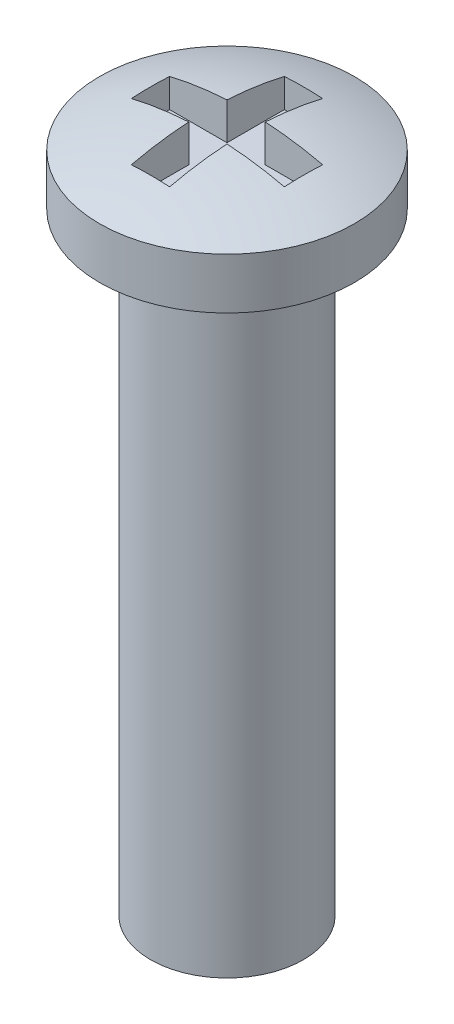
ISO-10303-21;
HEADER;
FILE_DESCRIPTION(('STEP AP214'),'2;1');
FILE_NAME('part.step','',(''),(''),'','','');
FILE_SCHEMA(('AUTOMOTIVE_DESIGN { 1 0 10303 214 1 1 1 1 }'));
ENDSEC;
DATA;
#1=APPLICATION_CONTEXT('core data for automotive mechanical design processes');
#2=APPLICATION_PROTOCOL_DEFINITION('international standard','automotive_design',2000,#1);
#3=PRODUCT_CONTEXT('',#1,'mechanical');
#4=PRODUCT('Part','Part','',(#3));
#5=PRODUCT_RELATED_PRODUCT_CATEGORY('part','',(#4));
#6=PRODUCT_DEFINITION_FORMATION('','',#4);
#7=PRODUCT_DEFINITION_CONTEXT('part definition',#1,'design');
#8=PRODUCT_DEFINITION('design','',#6,#7);
#9=PRODUCT_DEFINITION_SHAPE('','',#8);
#10=(LENGTH_UNIT() NAMED_UNIT(*) SI_UNIT(.MILLI.,.METRE.));
#11=(NAMED_UNIT(*) PLANE_ANGLE_UNIT() SI_UNIT($,.RADIAN.));
#12=(NAMED_UNIT(*) SI_UNIT($,.STERADIAN.) SOLID_ANGLE_UNIT());
#13=UNCERTAINTY_MEASURE_WITH_UNIT(LENGTH_MEASURE(1.E-05),#10,'distance_accuracy_value','');
#14=(GEOMETRIC_REPRESENTATION_CONTEXT(3) GLOBAL_UNCERTAINTY_ASSIGNED_CONTEXT((#13)) GLOBAL_UNIT_ASSIGNED_CONTEXT((#10,
#11,#12)) REPRESENTATION_CONTEXT('',''));
#15=CARTESIAN_POINT('',(0.,0.,0.));
#16=DIRECTION('',(0.,0.,1.));
#17=DIRECTION('',(1.,0.,0.));
#18=AXIS2_PLACEMENT_3D('',#15,#16,#17);
#19=CARTESIAN_POINT('',(0.,12.,0.));
#20=DIRECTION('',(0.,-1.,0.));
#21=DIRECTION('',(0.,0.,-1.));
#22=AXIS2_PLACEMENT_3D('',#19,#20,#21);
#23=CYLINDRICAL_SURFACE('',#22,1.5);
#24=CARTESIAN_POINT('',(0.,12.,0.));
#25=DIRECTION('',(0.,1.,0.));
#26=DIRECTION('',(0.,0.,1.));
#27=AXIS2_PLACEMENT_3D('',#24,#25,#26);
#28=CIRCLE('',#27,1.5);
#29=CARTESIAN_POINT('',(0.,12.,1.5));
#30=VERTEX_POINT('',#29);
#31=EDGE_CURVE('E197',#30,#30,#28,.T.);
#32=ORIENTED_EDGE('',*,*,#31,.F.);
#33=EDGE_LOOP('',(#32));
#34=FACE_BOUND('',#33,.T.);
#35=CARTESIAN_POINT('',(0.,0.,0.));
#36=DIRECTION('',(0.,1.,0.));
#37=DIRECTION('',(0.,0.,1.));
#38=AXIS2_PLACEMENT_3D('',#35,#36,#37);
#39=CIRCLE('',#38,1.5);
#40=CARTESIAN_POINT('',(0.,0.,1.5));
#41=VERTEX_POINT('',#40);
#42=EDGE_CURVE('E201',#41,#41,#39,.T.);
#43=ORIENTED_EDGE('',*,*,#42,.T.);
#44=EDGE_LOOP('',(#43));
#45=FACE_BOUND('',#44,.T.);
#46=ADVANCED_FACE('F34',(#34,#45),#23,.T.);
#47=CARTESIAN_POINT('',(0.,0.,0.));
#48=DIRECTION('',(0.,1.,0.));
#49=DIRECTION('',(0.,0.,1.));
#50=AXIS2_PLACEMENT_3D('',#47,#48,#49);
#51=PLANE('',#50);
#52=ORIENTED_EDGE('',*,*,#42,.F.);
#53=EDGE_LOOP('',(#52));
#54=FACE_BOUND('',#53,.T.);
#55=ADVANCED_FACE('F275',(#54),#51,.F.);
#56=CARTESIAN_POINT('',(0.,13.,0.));
#57=DIRECTION('',(0.,-1.,0.));
#58=DIRECTION('',(0.,0.,-1.));
#59=AXIS2_PLACEMENT_3D('',#56,#57,#58);
#60=CYLINDRICAL_SURFACE('',#59,2.5);
#61=CARTESIAN_POINT('',(0.,13.,0.));
#62=DIRECTION('',(0.,1.,0.));
#63=DIRECTION('',(0.,0.,1.));
#64=AXIS2_PLACEMENT_3D('',#61,#62,#63);
#65=CIRCLE('',#64,2.5);
#66=CARTESIAN_POINT('',(0.,13.,2.5));
#67=VERTEX_POINT('',#66);
#68=EDGE_CURVE('E196',#67,#67,#65,.T.);
#69=ORIENTED_EDGE('',*,*,#68,.F.);
#70=EDGE_LOOP('',(#69));
#71=FACE_BOUND('',#70,.T.);
#72=CARTESIAN_POINT('',(0.,12.,0.));
#73=DIRECTION('',(0.,1.,0.));
#74=DIRECTION('',(0.,0.,1.));
#75=AXIS2_PLACEMENT_3D('',#72,#73,#74);
#76=CIRCLE('',#75,2.5);
#77=CARTESIAN_POINT('',(0.,12.,2.5));
#78=VERTEX_POINT('',#77);
#79=EDGE_CURVE('E166',#78,#78,#76,.T.);
#80=ORIENTED_EDGE('',*,*,#79,.T.);
#81=EDGE_LOOP('',(#80));
#82=FACE_BOUND('',#81,.T.);
#83=ADVANCED_FACE('F280',(#71,#82),#60,.T.);
#84=CARTESIAN_POINT('',(0.,7.00000000000001,0.));
#85=DIRECTION('',(0.,0.,1.));
#86=DIRECTION('',(1.,0.,0.));
#87=AXIS2_PLACEMENT_3D('',#84,#85,#86);
#88=SPHERICAL_SURFACE('',#87,6.49999999999999);
#89=CARTESIAN_POINT('',(0.,7.00000000000001,0.375));
#90=DIRECTION('',(0.,0.,1.));
#91=DIRECTION('',(1.,0.,0.));
#92=AXIS2_PLACEMENT_3D('',#89,#90,#91);
#93=CIRCLE('',#92,6.4891736762087);
#94=CARTESIAN_POINT('',(-1.5,13.3134281495872,0.375));
#95=VERTEX_POINT('',#94);
#96=CARTESIAN_POINT('',(-0.375,13.478329259925,0.375));
#97=VERTEX_POINT('',#96);
#98=EDGE_CURVE('E11',#95,#97,#93,.F.);
#99=ORIENTED_EDGE('',*,*,#98,.F.);
#100=CARTESIAN_POINT('',(-1.5,7.00000000000001,0.));
#101=DIRECTION('',(-1.,0.,0.));
#102=DIRECTION('',(0.,0.,1.));
#103=AXIS2_PLACEMENT_3D('',#100,#101,#102);
#104=CIRCLE('',#103,6.32455532033675);
#105=CARTESIAN_POINT('',(-1.5,13.3134281495872,-0.375));
#106=VERTEX_POINT('',#105);
#107=EDGE_CURVE('E42',#106,#95,#104,.F.);
#108=ORIENTED_EDGE('',*,*,#107,.F.);
#109=CARTESIAN_POINT('',(0.,7.00000000000001,-0.375));
#110=DIRECTION('',(0.,0.,1.));
#111=DIRECTION('',(1.,0.,0.));
#112=AXIS2_PLACEMENT_3D('',#109,#110,#111);
#113=CIRCLE('',#112,6.4891736762087);
#114=CARTESIAN_POINT('',(-0.375,13.478329259925,-0.375));
#115=VERTEX_POINT('',#114);
#116=EDGE_CURVE('E228',#106,#115,#113,.F.);
#117=ORIENTED_EDGE('',*,*,#116,.T.);
#118=CARTESIAN_POINT('',(-0.375,7.00000000000001,0.));
#119=DIRECTION('',(-1.,0.,0.));
#120=DIRECTION('',(0.,0.,1.));
#121=AXIS2_PLACEMENT_3D('',#118,#119,#120);
#122=CIRCLE('',#121,6.4891736762087);
#123=CARTESIAN_POINT('',(-0.375,13.3134281495872,-1.5));
#124=VERTEX_POINT('',#123);
#125=EDGE_CURVE('E226',#124,#115,#122,.F.);
#126=ORIENTED_EDGE('',*,*,#125,.F.);
#127=CARTESIAN_POINT('',(0.,7.00000000000001,-1.5));
#128=DIRECTION('',(0.,0.,1.));
#129=DIRECTION('',(1.,0.,0.));
#130=AXIS2_PLACEMENT_3D('',#127,#128,#129);
#131=CIRCLE('',#130,6.32455532033675);
#132=CARTESIAN_POINT('',(0.375,13.3134281495872,-1.5));
#133=VERTEX_POINT('',#132);
#134=EDGE_CURVE('E223',#124,#133,#131,.F.);
#135=ORIENTED_EDGE('',*,*,#134,.T.);
#136=CARTESIAN_POINT('',(0.375,7.00000000000001,0.));
#137=DIRECTION('',(-1.,0.,0.));
#138=DIRECTION('',(0.,0.,1.));
#139=AXIS2_PLACEMENT_3D('',#136,#137,#138);
#140=CIRCLE('',#139,6.4891736762087);
#141=CARTESIAN_POINT('',(0.375,13.478329259925,-0.375));
#142=VERTEX_POINT('',#141);
#143=EDGE_CURVE('E220',#133,#142,#140,.F.);
#144=ORIENTED_EDGE('',*,*,#143,.T.);
#145=CARTESIAN_POINT('',(0.,7.00000000000001,-0.375));
#146=DIRECTION('',(0.,0.,1.));
#147=DIRECTION('',(1.,0.,0.));
#148=AXIS2_PLACEMENT_3D('',#145,#146,#147);
#149=CIRCLE('',#148,6.4891736762087);
#150=CARTESIAN_POINT('',(1.5,13.3134281495872,-0.375));
#151=VERTEX_POINT('',#150);
#152=EDGE_CURVE('E217',#142,#151,#149,.F.);
#153=ORIENTED_EDGE('',*,*,#152,.T.);
#154=CARTESIAN_POINT('',(1.5,7.00000000000001,0.));
#155=DIRECTION('',(-1.,0.,0.));
#156=DIRECTION('',(0.,0.,1.));
#157=AXIS2_PLACEMENT_3D('',#154,#155,#156);
#158=CIRCLE('',#157,6.32455532033675);
#159=CARTESIAN_POINT('',(1.5,13.3134281495872,0.375));
#160=VERTEX_POINT('',#159);
#161=EDGE_CURVE('E214',#151,#160,#158,.F.);
#162=ORIENTED_EDGE('',*,*,#161,.T.);
#163=CARTESIAN_POINT('',(0.,7.00000000000001,0.375));
#164=DIRECTION('',(0.,0.,1.));
#165=DIRECTION('',(1.,0.,0.));
#166=AXIS2_PLACEMENT_3D('',#163,#164,#165);
#167=CIRCLE('',#166,6.4891736762087);
#168=CARTESIAN_POINT('',(0.375,13.478329259925,0.375));
#169=VERTEX_POINT('',#168);
#170=EDGE_CURVE('E212',#169,#160,#167,.F.);
#171=ORIENTED_EDGE('',*,*,#170,.F.);
#172=CARTESIAN_POINT('',(0.375,7.00000000000001,0.));
#173=DIRECTION('',(-1.,0.,0.));
#174=DIRECTION('',(0.,0.,1.));
#175=AXIS2_PLACEMENT_3D('',#172,#173,#174);
#176=CIRCLE('',#175,6.4891736762087);
#177=CARTESIAN_POINT('',(0.375,13.3134281495872,1.5));
#178=VERTEX_POINT('',#177);
#179=EDGE_CURVE('E209',#169,#178,#176,.F.);
#180=ORIENTED_EDGE('',*,*,#179,.T.);
#181=CARTESIAN_POINT('',(0.,7.00000000000001,1.5));
#182=DIRECTION('',(0.,0.,1.));
#183=DIRECTION('',(1.,0.,0.));
#184=AXIS2_PLACEMENT_3D('',#181,#182,#183);
#185=CIRCLE('',#184,6.32455532033675);
#186=CARTESIAN_POINT('',(-0.375,13.3134281495872,1.5));
#187=VERTEX_POINT('',#186);
#188=EDGE_CURVE('E207',#187,#178,#185,.F.);
#189=ORIENTED_EDGE('',*,*,#188,.F.);
#190=CARTESIAN_POINT('',(-0.375,7.00000000000001,0.));
#191=DIRECTION('',(-1.,0.,0.));
#192=DIRECTION('',(0.,0.,1.));
#193=AXIS2_PLACEMENT_3D('',#190,#191,#192);
#194=CIRCLE('',#193,6.4891736762087);
#195=EDGE_CURVE('E200',#97,#187,#194,.F.);
#196=ORIENTED_EDGE('',*,*,#195,.F.);
#197=EDGE_LOOP('',(#99,#108,#117,#126,#135,#144,#153,#162,#171,#180,#189,#196));
#198=FACE_BOUND('',#197,.T.);
#199=ORIENTED_EDGE('',*,*,#68,.T.);
#200=EDGE_LOOP('',(#199));
#201=FACE_BOUND('',#200,.T.);
#202=ADVANCED_FACE('F36',(#198,#201),#88,.T.);
#203=CARTESIAN_POINT('',(0.,12.,0.));
#204=DIRECTION('',(0.,1.,0.));
#205=DIRECTION('',(0.,0.,1.));
#206=AXIS2_PLACEMENT_3D('',#203,#204,#205);
#207=PLANE('',#206);
#208=ORIENTED_EDGE('',*,*,#31,.T.);
#209=EDGE_LOOP('',(#208));
#210=FACE_BOUND('',#209,.T.);
#211=ORIENTED_EDGE('',*,*,#79,.F.);
#212=EDGE_LOOP('',(#211));
#213=FACE_BOUND('',#212,.T.);
#214=ADVANCED_FACE('F289',(#210,#213),#207,.F.);
#215=CARTESIAN_POINT('',(0.,12.75,0.375));
#216=DIRECTION('',(0.,0.,1.));
#217=DIRECTION('',(1.,0.,0.));
#218=AXIS2_PLACEMENT_3D('',#215,#216,#217);
#219=PLANE('',#218);
#220=ORIENTED_EDGE('',*,*,#98,.T.);
#221=DIRECTION('',(0.,1.,0.));
#222=VECTOR('',#221,1.);
#223=CARTESIAN_POINT('',(-0.375,12.75,0.375));
#224=LINE('',#223,#222);
#225=CARTESIAN_POINT('',(-0.375,12.75,0.375));
#226=VERTEX_POINT('',#225);
#227=EDGE_CURVE('E49',#226,#97,#224,.T.);
#228=ORIENTED_EDGE('',*,*,#227,.F.);
#229=DIRECTION('',(1.,0.,0.));
#230=VECTOR('',#229,1.);
#231=CARTESIAN_POINT('',(0.,12.75,0.375));
#232=LINE('',#231,#230);
#233=CARTESIAN_POINT('',(-1.5,12.75,0.375));
#234=VERTEX_POINT('',#233);
#235=EDGE_CURVE('E123',#234,#226,#232,.T.);
#236=ORIENTED_EDGE('',*,*,#235,.F.);
#237=DIRECTION('',(0.,1.,0.));
#238=VECTOR('',#237,1.);
#239=CARTESIAN_POINT('',(-1.5,12.75,0.375));
#240=LINE('',#239,#238);
#241=EDGE_CURVE('E164',#234,#95,#240,.T.);
#242=ORIENTED_EDGE('',*,*,#241,.T.);
#243=EDGE_LOOP('',(#220,#228,#236,#242));
#244=FACE_BOUND('',#243,.T.);
#245=ADVANCED_FACE('F121',(#244),#219,.F.);
#246=CARTESIAN_POINT('',(-1.5,12.75,0.));
#247=DIRECTION('',(-1.,0.,0.));
#248=DIRECTION('',(0.,0.,1.));
#249=AXIS2_PLACEMENT_3D('',#246,#247,#248);
#250=PLANE('',#249);
#251=ORIENTED_EDGE('',*,*,#107,.T.);
#252=ORIENTED_EDGE('',*,*,#241,.F.);
#253=DIRECTION('',(0.,0.,1.));
#254=VECTOR('',#253,1.);
#255=CARTESIAN_POINT('',(-1.5,12.75,0.));
#256=LINE('',#255,#254);
#257=CARTESIAN_POINT('',(-1.5,12.75,-0.375));
#258=VERTEX_POINT('',#257);
#259=EDGE_CURVE('E128',#258,#234,#256,.T.);
#260=ORIENTED_EDGE('',*,*,#259,.F.);
#261=DIRECTION('',(0.,1.,0.));
#262=VECTOR('',#261,1.);
#263=CARTESIAN_POINT('',(-1.5,12.75,-0.375));
#264=LINE('',#263,#262);
#265=EDGE_CURVE('E167',#258,#106,#264,.T.);
#266=ORIENTED_EDGE('',*,*,#265,.T.);
#267=EDGE_LOOP('',(#251,#252,#260,#266));
#268=FACE_BOUND('',#267,.T.);
#269=ADVANCED_FACE('F236',(#268),#250,.F.);
#270=CARTESIAN_POINT('',(0.,12.75,-0.375));
#271=DIRECTION('',(0.,0.,1.));
#272=DIRECTION('',(1.,0.,0.));
#273=AXIS2_PLACEMENT_3D('',#270,#271,#272);
#274=PLANE('',#273);
#275=ORIENTED_EDGE('',*,*,#265,.F.);
#276=DIRECTION('',(1.,0.,0.));
#277=VECTOR('',#276,1.);
#278=CARTESIAN_POINT('',(0.,12.75,-0.375));
#279=LINE('',#278,#277);
#280=CARTESIAN_POINT('',(-0.375,12.75,-0.375));
#281=VERTEX_POINT('',#280);
#282=EDGE_CURVE('E161',#258,#281,#279,.T.);
#283=ORIENTED_EDGE('',*,*,#282,.T.);
#284=DIRECTION('',(0.,1.,0.));
#285=VECTOR('',#284,1.);
#286=CARTESIAN_POINT('',(-0.375,12.75,-0.375));
#287=LINE('',#286,#285);
#288=EDGE_CURVE('E169',#281,#115,#287,.T.);
#289=ORIENTED_EDGE('',*,*,#288,.T.);
#290=ORIENTED_EDGE('',*,*,#116,.F.);
#291=EDGE_LOOP('',(#275,#283,#289,#290));
#292=FACE_BOUND('',#291,.T.);
#293=ADVANCED_FACE('F234',(#292),#274,.T.);
#294=CARTESIAN_POINT('',(-0.375,12.75,0.));
#295=DIRECTION('',(-1.,0.,0.));
#296=DIRECTION('',(0.,0.,1.));
#297=AXIS2_PLACEMENT_3D('',#294,#295,#296);
#298=PLANE('',#297);
#299=ORIENTED_EDGE('',*,*,#125,.T.);
#300=ORIENTED_EDGE('',*,*,#288,.F.);
#301=DIRECTION('',(0.,0.,1.));
#302=VECTOR('',#301,1.);
#303=CARTESIAN_POINT('',(-0.375,12.75,0.));
#304=LINE('',#303,#302);
#305=CARTESIAN_POINT('',(-0.375,12.75,-1.5));
#306=VERTEX_POINT('',#305);
#307=EDGE_CURVE('E158',#306,#281,#304,.T.);
#308=ORIENTED_EDGE('',*,*,#307,.F.);
#309=DIRECTION('',(0.,1.,0.));
#310=VECTOR('',#309,1.);
#311=CARTESIAN_POINT('',(-0.375,12.75,-1.5));
#312=LINE('',#311,#310);
#313=EDGE_CURVE('E172',#306,#124,#312,.T.);
#314=ORIENTED_EDGE('',*,*,#313,.T.);
#315=EDGE_LOOP('',(#299,#300,#308,#314));
#316=FACE_BOUND('',#315,.T.);
#317=ADVANCED_FACE('F264',(#316),#298,.F.);
#318=CARTESIAN_POINT('',(0.,12.75,-1.5));
#319=DIRECTION('',(0.,0.,1.));
#320=DIRECTION('',(1.,0.,0.));
#321=AXIS2_PLACEMENT_3D('',#318,#319,#320);
#322=PLANE('',#321);
#323=ORIENTED_EDGE('',*,*,#313,.F.);
#324=DIRECTION('',(1.,0.,0.));
#325=VECTOR('',#324,1.);
#326=CARTESIAN_POINT('',(0.,12.75,-1.5));
#327=LINE('',#326,#325);
#328=CARTESIAN_POINT('',(0.375,12.75,-1.5));
#329=VERTEX_POINT('',#328);
#330=EDGE_CURVE('E156',#306,#329,#327,.T.);
#331=ORIENTED_EDGE('',*,*,#330,.T.);
#332=DIRECTION('',(0.,1.,0.));
#333=VECTOR('',#332,1.);
#334=CARTESIAN_POINT('',(0.375,12.75,-1.5));
#335=LINE('',#334,#333);
#336=EDGE_CURVE('E175',#329,#133,#335,.T.);
#337=ORIENTED_EDGE('',*,*,#336,.T.);
#338=ORIENTED_EDGE('',*,*,#134,.F.);
#339=EDGE_LOOP('',(#323,#331,#337,#338));
#340=FACE_BOUND('',#339,.T.);
#341=ADVANCED_FACE('F265',(#340),#322,.T.);
#342=CARTESIAN_POINT('',(0.375,12.75,0.));
#343=DIRECTION('',(-1.,0.,0.));
#344=DIRECTION('',(0.,0.,1.));
#345=AXIS2_PLACEMENT_3D('',#342,#343,#344);
#346=PLANE('',#345);
#347=ORIENTED_EDGE('',*,*,#336,.F.);
#348=DIRECTION('',(0.,0.,1.));
#349=VECTOR('',#348,1.);
#350=CARTESIAN_POINT('',(0.375,12.75,0.));
#351=LINE('',#350,#349);
#352=CARTESIAN_POINT('',(0.375,12.75,-0.375));
#353=VERTEX_POINT('',#352);
#354=EDGE_CURVE('E154',#329,#353,#351,.T.);
#355=ORIENTED_EDGE('',*,*,#354,.T.);
#356=DIRECTION('',(0.,1.,0.));
#357=VECTOR('',#356,1.);
#358=CARTESIAN_POINT('',(0.375,12.75,-0.375));
#359=LINE('',#358,#357);
#360=EDGE_CURVE('E178',#353,#142,#359,.T.);
#361=ORIENTED_EDGE('',*,*,#360,.T.);
#362=ORIENTED_EDGE('',*,*,#143,.F.);
#363=EDGE_LOOP('',(#347,#355,#361,#362));
#364=FACE_BOUND('',#363,.T.);
#365=ADVANCED_FACE('F258',(#364),#346,.T.);
#366=CARTESIAN_POINT('',(0.,12.75,-0.375));
#367=DIRECTION('',(0.,0.,1.));
#368=DIRECTION('',(1.,0.,0.));
#369=AXIS2_PLACEMENT_3D('',#366,#367,#368);
#370=PLANE('',#369);
#371=ORIENTED_EDGE('',*,*,#360,.F.);
#372=DIRECTION('',(1.,0.,0.));
#373=VECTOR('',#372,1.);
#374=CARTESIAN_POINT('',(0.,12.75,-0.375));
#375=LINE('',#374,#373);
#376=CARTESIAN_POINT('',(1.5,12.75,-0.375));
#377=VERTEX_POINT('',#376);
#378=EDGE_CURVE('E152',#353,#377,#375,.T.);
#379=ORIENTED_EDGE('',*,*,#378,.T.);
#380=DIRECTION('',(0.,1.,0.));
#381=VECTOR('',#380,1.);
#382=CARTESIAN_POINT('',(1.5,12.75,-0.375));
#383=LINE('',#382,#381);
#384=EDGE_CURVE('E181',#377,#151,#383,.T.);
#385=ORIENTED_EDGE('',*,*,#384,.T.);
#386=ORIENTED_EDGE('',*,*,#152,.F.);
#387=EDGE_LOOP('',(#371,#379,#385,#386));
#388=FACE_BOUND('',#387,.T.);
#389=ADVANCED_FACE('F254',(#388),#370,.T.);
#390=CARTESIAN_POINT('',(1.5,12.75,0.));
#391=DIRECTION('',(-1.,0.,0.));
#392=DIRECTION('',(0.,0.,1.));
#393=AXIS2_PLACEMENT_3D('',#390,#391,#392);
#394=PLANE('',#393);
#395=ORIENTED_EDGE('',*,*,#384,.F.);
#396=DIRECTION('',(0.,0.,1.));
#397=VECTOR('',#396,1.);
#398=CARTESIAN_POINT('',(1.5,12.75,0.));
#399=LINE('',#398,#397);
#400=CARTESIAN_POINT('',(1.5,12.75,0.375));
#401=VERTEX_POINT('',#400);
#402=EDGE_CURVE('E150',#377,#401,#399,.T.);
#403=ORIENTED_EDGE('',*,*,#402,.T.);
#404=DIRECTION('',(0.,1.,0.));
#405=VECTOR('',#404,1.);
#406=CARTESIAN_POINT('',(1.5,12.75,0.375));
#407=LINE('',#406,#405);
#408=EDGE_CURVE('E184',#401,#160,#407,.T.);
#409=ORIENTED_EDGE('',*,*,#408,.T.);
#410=ORIENTED_EDGE('',*,*,#161,.F.);
#411=EDGE_LOOP('',(#395,#403,#409,#410));
#412=FACE_BOUND('',#411,.T.);
#413=ADVANCED_FACE('F251',(#412),#394,.T.);
#414=CARTESIAN_POINT('',(0.,12.75,0.375));
#415=DIRECTION('',(0.,0.,1.));
#416=DIRECTION('',(1.,0.,0.));
#417=AXIS2_PLACEMENT_3D('',#414,#415,#416);
#418=PLANE('',#417);
#419=ORIENTED_EDGE('',*,*,#170,.T.);
#420=ORIENTED_EDGE('',*,*,#408,.F.);
#421=DIRECTION('',(1.,0.,0.));
#422=VECTOR('',#421,1.);
#423=CARTESIAN_POINT('',(0.,12.75,0.375));
#424=LINE('',#423,#422);
#425=CARTESIAN_POINT('',(0.375,12.75,0.375));
#426=VERTEX_POINT('',#425);
#427=EDGE_CURVE('E147',#426,#401,#424,.T.);
#428=ORIENTED_EDGE('',*,*,#427,.F.);
#429=DIRECTION('',(0.,1.,0.));
#430=VECTOR('',#429,1.);
#431=CARTESIAN_POINT('',(0.375,12.75,0.375));
#432=LINE('',#431,#430);
#433=EDGE_CURVE('E187',#426,#169,#432,.T.);
#434=ORIENTED_EDGE('',*,*,#433,.T.);
#435=EDGE_LOOP('',(#419,#420,#428,#434));
#436=FACE_BOUND('',#435,.T.);
#437=ADVANCED_FACE('F247',(#436),#418,.F.);
#438=CARTESIAN_POINT('',(0.375,12.75,0.));
#439=DIRECTION('',(-1.,0.,0.));
#440=DIRECTION('',(0.,0.,1.));
#441=AXIS2_PLACEMENT_3D('',#438,#439,#440);
#442=PLANE('',#441);
#443=ORIENTED_EDGE('',*,*,#433,.F.);
#444=DIRECTION('',(0.,0.,1.));
#445=VECTOR('',#444,1.);
#446=CARTESIAN_POINT('',(0.375,12.75,0.));
#447=LINE('',#446,#445);
#448=CARTESIAN_POINT('',(0.375,12.75,1.5));
#449=VERTEX_POINT('',#448);
#450=EDGE_CURVE('E145',#426,#449,#447,.T.);
#451=ORIENTED_EDGE('',*,*,#450,.T.);
#452=DIRECTION('',(0.,1.,0.));
#453=VECTOR('',#452,1.);
#454=CARTESIAN_POINT('',(0.375,12.75,1.5));
#455=LINE('',#454,#453);
#456=EDGE_CURVE('E190',#449,#178,#455,.T.);
#457=ORIENTED_EDGE('',*,*,#456,.T.);
#458=ORIENTED_EDGE('',*,*,#179,.F.);
#459=EDGE_LOOP('',(#443,#451,#457,#458));
#460=FACE_BOUND('',#459,.T.);
#461=ADVANCED_FACE('F299',(#460),#442,.T.);
#462=CARTESIAN_POINT('',(0.,12.75,1.5));
#463=DIRECTION('',(0.,0.,1.));
#464=DIRECTION('',(1.,0.,0.));
#465=AXIS2_PLACEMENT_3D('',#462,#463,#464);
#466=PLANE('',#465);
#467=ORIENTED_EDGE('',*,*,#188,.T.);
#468=ORIENTED_EDGE('',*,*,#456,.F.);
#469=DIRECTION('',(1.,0.,0.));
#470=VECTOR('',#469,1.);
#471=CARTESIAN_POINT('',(0.,12.75,1.5));
#472=LINE('',#471,#470);
#473=CARTESIAN_POINT('',(-0.375,12.75,1.5));
#474=VERTEX_POINT('',#473);
#475=EDGE_CURVE('E137',#474,#449,#472,.T.);
#476=ORIENTED_EDGE('',*,*,#475,.F.);
#477=DIRECTION('',(0.,1.,0.));
#478=VECTOR('',#477,1.);
#479=CARTESIAN_POINT('',(-0.375,12.75,1.5));
#480=LINE('',#479,#478);
#481=EDGE_CURVE('E127',#474,#187,#480,.T.);
#482=ORIENTED_EDGE('',*,*,#481,.T.);
#483=EDGE_LOOP('',(#467,#468,#476,#482));
#484=FACE_BOUND('',#483,.T.);
#485=ADVANCED_FACE('F239',(#484),#466,.F.);
#486=CARTESIAN_POINT('',(-0.375,12.75,0.));
#487=DIRECTION('',(-1.,0.,0.));
#488=DIRECTION('',(0.,0.,1.));
#489=AXIS2_PLACEMENT_3D('',#486,#487,#488);
#490=PLANE('',#489);
#491=ORIENTED_EDGE('',*,*,#195,.T.);
#492=ORIENTED_EDGE('',*,*,#481,.F.);
#493=DIRECTION('',(0.,0.,1.));
#494=VECTOR('',#493,1.);
#495=CARTESIAN_POINT('',(-0.375,12.75,0.));
#496=LINE('',#495,#494);
#497=EDGE_CURVE('E131',#226,#474,#496,.T.);
#498=ORIENTED_EDGE('',*,*,#497,.F.);
#499=ORIENTED_EDGE('',*,*,#227,.T.);
#500=EDGE_LOOP('',(#491,#492,#498,#499));
#501=FACE_BOUND('',#500,.T.);
#502=ADVANCED_FACE('F132',(#501),#490,.F.);
#503=CARTESIAN_POINT('',(0.,12.75,0.));
#504=DIRECTION('',(0.,1.,0.));
#505=DIRECTION('',(0.,0.,1.));
#506=AXIS2_PLACEMENT_3D('',#503,#504,#505);
#507=PLANE('',#506);
#508=ORIENTED_EDGE('',*,*,#235,.T.);
#509=ORIENTED_EDGE('',*,*,#497,.T.);
#510=ORIENTED_EDGE('',*,*,#475,.T.);
#511=ORIENTED_EDGE('',*,*,#450,.F.);
#512=ORIENTED_EDGE('',*,*,#427,.T.);
#513=ORIENTED_EDGE('',*,*,#402,.F.);
#514=ORIENTED_EDGE('',*,*,#378,.F.);
#515=ORIENTED_EDGE('',*,*,#354,.F.);
#516=ORIENTED_EDGE('',*,*,#330,.F.);
#517=ORIENTED_EDGE('',*,*,#307,.T.);
#518=ORIENTED_EDGE('',*,*,#282,.F.);
#519=ORIENTED_EDGE('',*,*,#259,.T.);
#520=EDGE_LOOP('',(#508,#509,#510,#511,#512,#513,#514,#515,#516,#517,#518,#519));
#521=FACE_BOUND('',#520,.T.);
#522=ADVANCED_FACE('F139',(#521),#507,.T.);
#523=CLOSED_SHELL('',(#46,#55,#83,#202,#214,#245,#269,#293,#317,#341,#365,#389,#413,#437,#461,
#485,#502,#522));
#524=MANIFOLD_SOLID_BREP('B2',#523);
#525=ADVANCED_BREP_SHAPE_REPRESENTATION('',(#18,#524),#14);
#526=SHAPE_DEFINITION_REPRESENTATION(#9,#525);
ENDSEC;
END-ISO-10303-21;
